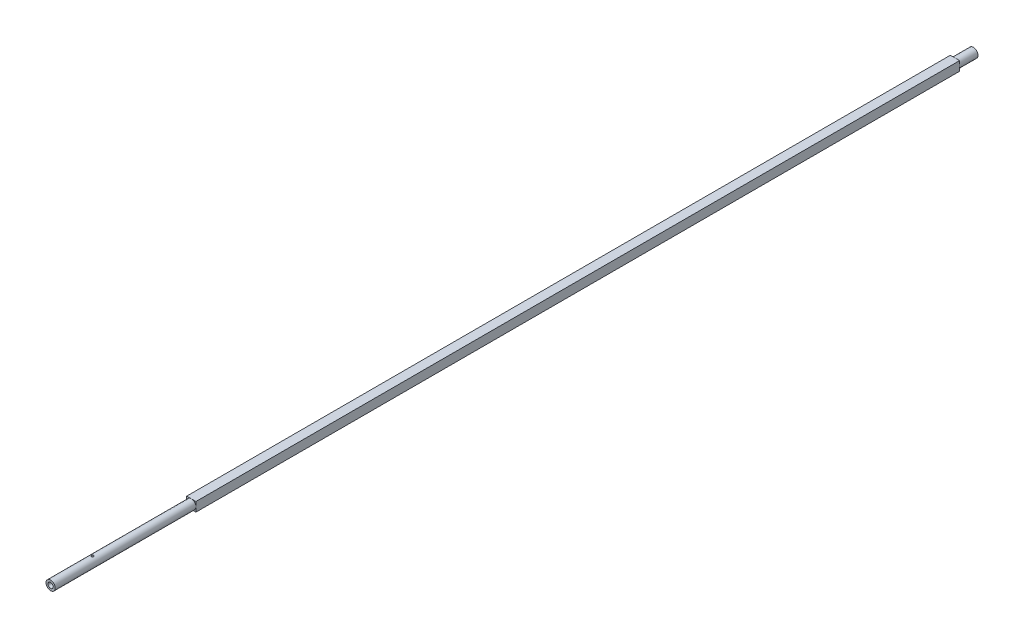
ISO-10303-21;
HEADER;
FILE_DESCRIPTION(('STEP AP214'),'2;1');
FILE_NAME('part.step','',(''),(''),'','','');
FILE_SCHEMA(('AUTOMOTIVE_DESIGN { 1 0 10303 214 1 1 1 1 }'));
ENDSEC;
DATA;
#1=APPLICATION_CONTEXT('core data for automotive mechanical design processes');
#2=APPLICATION_PROTOCOL_DEFINITION('international standard','automotive_design',2000,#1);
#3=PRODUCT_CONTEXT('',#1,'mechanical');
#4=PRODUCT('Part','Part','',(#3));
#5=PRODUCT_RELATED_PRODUCT_CATEGORY('part','',(#4));
#6=PRODUCT_DEFINITION_FORMATION('','',#4);
#7=PRODUCT_DEFINITION_CONTEXT('part definition',#1,'design');
#8=PRODUCT_DEFINITION('design','',#6,#7);
#9=PRODUCT_DEFINITION_SHAPE('','',#8);
#10=(LENGTH_UNIT() NAMED_UNIT(*) SI_UNIT(.MILLI.,.METRE.));
#11=(NAMED_UNIT(*) PLANE_ANGLE_UNIT() SI_UNIT($,.RADIAN.));
#12=(NAMED_UNIT(*) SI_UNIT($,.STERADIAN.) SOLID_ANGLE_UNIT());
#13=UNCERTAINTY_MEASURE_WITH_UNIT(LENGTH_MEASURE(1.E-05),#10,'distance_accuracy_value','');
#14=(GEOMETRIC_REPRESENTATION_CONTEXT(3) GLOBAL_UNCERTAINTY_ASSIGNED_CONTEXT((#13)) GLOBAL_UNIT_ASSIGNED_CONTEXT((#10,
#11,#12)) REPRESENTATION_CONTEXT('',''));
#15=CARTESIAN_POINT('',(0.,0.,0.));
#16=DIRECTION('',(0.,0.,1.));
#17=DIRECTION('',(1.,0.,0.));
#18=AXIS2_PLACEMENT_3D('',#15,#16,#17);
#19=CARTESIAN_POINT('',(0.,0.,0.));
#20=DIRECTION('',(0.,0.,-1.));
#21=DIRECTION('',(-1.,0.,0.));
#22=AXIS2_PLACEMENT_3D('',#19,#20,#21);
#23=CYLINDRICAL_SURFACE('',#22,3.15499999999999);
#24=CARTESIAN_POINT('',(0.,-3.15499999999999,68.27));
#25=CARTESIAN_POINT('',(-0.0428434035980619,-3.15499926048428,68.269998755018));
#26=CARTESIAN_POINT('',(-0.0857008689730935,-3.15411858978364,68.2664353493159));
#27=CARTESIAN_POINT('',(-0.17018910161884,-3.15069071162756,68.2522962573295));
#28=CARTESIAN_POINT('',(-0.211819132037599,-3.14814252359348,68.2417164450189));
#29=CARTESIAN_POINT('',(-0.292620072576786,-3.14166201143922,68.2139032503667));
#30=CARTESIAN_POINT('',(-0.331793817241801,-3.13773131870047,68.1966777077995));
#31=CARTESIAN_POINT('',(-0.406695385445936,-3.12890523512156,68.1560892192831));
#32=CARTESIAN_POINT('',(-0.442423122027183,-3.12400981994672,68.1327261185118));
#33=CARTESIAN_POINT('',(-0.510130903957554,-3.11367735158937,68.0800336300612));
#34=CARTESIAN_POINT('',(-0.542032461447429,-3.10823217478582,68.0506049758489));
#35=CARTESIAN_POINT('',(-0.600500381895767,-3.09746832578942,67.9868293666961));
#36=CARTESIAN_POINT('',(-0.627066162448737,-3.09214966746199,67.9524818755596));
#37=CARTESIAN_POINT('',(-0.674474185695767,-3.082159435371,67.8792384405704));
#38=CARTESIAN_POINT('',(-0.695229253223512,-3.07749818972666,67.8402845347032));
#39=CARTESIAN_POINT('',(-0.729866294223732,-3.06946876016744,67.7593076903811));
#40=CARTESIAN_POINT('',(-0.743749324909623,-3.06610037737282,67.7172852251442));
#41=CARTESIAN_POINT('',(-0.763981667633034,-3.06112144443012,67.6322255380142));
#42=CARTESIAN_POINT('',(-0.770471795620135,-3.05947808637917,67.5892237751899));
#43=CARTESIAN_POINT('',(-0.776172614536864,-3.0580370200745,67.5027128164703));
#44=CARTESIAN_POINT('',(-0.77538444634608,-3.05823902255878,67.4592037011708));
#45=CARTESIAN_POINT('',(-0.766663538406798,-3.06043633103726,67.3739874773659));
#46=CARTESIAN_POINT('',(-0.758897963327654,-3.06238967605256,67.3322620112507));
#47=CARTESIAN_POINT('',(-0.736709073607197,-3.06780278377902,67.2507249777486));
#48=CARTESIAN_POINT('',(-0.722285299303879,-3.07126265049497,67.2109135427101));
#49=CARTESIAN_POINT('',(-0.687045395789382,-3.07933788839243,67.1338832586499));
#50=CARTESIAN_POINT('',(-0.666168073404984,-3.0839642393672,67.0966936036748));
#51=CARTESIAN_POINT('',(-0.618656532309677,-3.09384489758779,67.026285212751));
#52=CARTESIAN_POINT('',(-0.592021338374359,-3.09909931114257,66.9930671509626));
#53=CARTESIAN_POINT('',(-0.532881439131852,-3.1098212306966,66.9305862434724));
#54=CARTESIAN_POINT('',(-0.500235502628048,-3.11529062373362,66.9014572381472));
#55=CARTESIAN_POINT('',(-0.430457000832696,-3.12569579383268,66.8490624417174));
#56=CARTESIAN_POINT('',(-0.393324307698854,-3.13063155568223,66.825796817738));
#57=CARTESIAN_POINT('',(-0.315439460001198,-3.13943654001288,66.7857424688628));
#58=CARTESIAN_POINT('',(-0.274676023963125,-3.14330227322213,66.7689748639727));
#59=CARTESIAN_POINT('',(-0.190793091323864,-3.14950620185087,66.7425669854447));
#60=CARTESIAN_POINT('',(-0.147674030965758,-3.15184467907394,66.7329253968975));
#61=CARTESIAN_POINT('',(-0.0614486931992635,-3.15468914288634,66.7212462063279));
#62=CARTESIAN_POINT('',(-0.0183685274254357,-3.15523906320459,66.7190262616943));
#63=CARTESIAN_POINT('',(0.0675476236497106,-3.15456928701988,66.7217541229676));
#64=CARTESIAN_POINT('',(0.110383629799756,-3.15334974395432,66.7267013073835));
#65=CARTESIAN_POINT('',(0.193966197740732,-3.14930616413586,66.7434725379454));
#66=CARTESIAN_POINT('',(0.23473382509393,-3.14650521900655,66.7551976700822));
#67=CARTESIAN_POINT('',(0.313721801449216,-3.13961412652606,66.7850794509468));
#68=CARTESIAN_POINT('',(0.351941898010841,-3.13552385164174,66.8032367359285));
#69=CARTESIAN_POINT('',(0.42547958392159,-3.12640207341987,66.845824648126));
#70=CARTESIAN_POINT('',(0.460735692863985,-3.12135554355747,66.8703581401234));
#71=CARTESIAN_POINT('',(0.526695422691903,-3.11090566670997,66.9248700020623));
#72=CARTESIAN_POINT('',(0.557398284994112,-3.10550226048454,66.9548492774392));
#73=CARTESIAN_POINT('',(0.614127020455047,-3.09479039352677,67.0202470514131));
#74=CARTESIAN_POINT('',(0.640025199323583,-3.08948719539553,67.0557773609553));
#75=CARTESIAN_POINT('',(0.685490746342258,-3.07971919430867,67.1307878390656));
#76=CARTESIAN_POINT('',(0.705058397210639,-3.07525435391615,67.1702678311398));
#77=CARTESIAN_POINT('',(0.737162929617569,-3.06771704697936,67.2518433424251));
#78=CARTESIAN_POINT('',(0.749741449844652,-3.0646363557007,67.2939216751133));
#79=CARTESIAN_POINT('',(0.767622634584383,-3.0602070090432,67.3796826301342));
#80=CARTESIAN_POINT('',(0.772926825028732,-3.05885799041625,67.4233649140323));
#81=CARTESIAN_POINT('',(0.776031146509615,-3.05807173201391,67.5097962465477));
#82=CARTESIAN_POINT('',(0.774035107202722,-3.0585825616097,67.5525376211588));
#83=CARTESIAN_POINT('',(0.763060538255976,-3.06133876001959,67.6370544045251));
#84=CARTESIAN_POINT('',(0.754082139670096,-3.06358409627821,67.6788298313953));
#85=CARTESIAN_POINT('',(0.729507243124496,-3.06952788434702,67.7600160142471));
#86=CARTESIAN_POINT('',(0.713947723814153,-3.07321820844353,67.7994385993389));
#87=CARTESIAN_POINT('',(0.676681749216461,-3.08163757135176,67.8751413221453));
#88=CARTESIAN_POINT('',(0.6549744708751,-3.08636674922484,67.911421038247));
#89=CARTESIAN_POINT('',(0.605384741907677,-3.09648008399222,67.9807961092229));
#90=CARTESIAN_POINT('',(0.577360283757076,-3.10187775774646,68.0137880032733));
#91=CARTESIAN_POINT('',(0.516210101989471,-3.11263781553505,68.0746671899676));
#92=CARTESIAN_POINT('',(0.48308317486633,-3.1180001909317,68.1025532749125));
#93=CARTESIAN_POINT('',(0.411976050375955,-3.12819619645481,68.1528990319865));
#94=CARTESIAN_POINT('',(0.373921741092796,-3.13301906187442,68.1752563692315));
#95=CARTESIAN_POINT('',(0.294480382839351,-3.14148001054233,68.2132208756048));
#96=CARTESIAN_POINT('',(0.253095809905168,-3.14511896405556,68.2288330057525));
#97=CARTESIAN_POINT('',(0.176472252043087,-3.15024746023148,68.2504770036731));
#98=CARTESIAN_POINT('',(0.141606284601708,-3.15201760271577,68.2577825868709));
#99=CARTESIAN_POINT('',(0.0711634120339031,-3.1543941390154,68.2675444324384));
#100=CARTESIAN_POINT('',(0.0355865568264515,-3.15500061425601,68.270001034106));
#101=CARTESIAN_POINT('',(0.,-3.15499999999999,68.27));
#102=B_SPLINE_CURVE_WITH_KNOTS('',3,(#24,#25,#26,#27,#28,#29,#30,#31,#32,#33,#34,#35,#36,#37,
#38,#39,#40,#41,#42,#43,#44,#45,#46,#47,#48,#49,#50,#51,#52,#53,#54,#55,#56,#57,#58,#59,#60,#61,
#62,#63,#64,#65,#66,#67,#68,#69,#70,#71,#72,#73,#74,#75,#76,#77,#78,#79,#80,#81,#82,#83,#84,#85,
#86,#87,#88,#89,#90,#91,#92,#93,#94,#95,#96,#97,#98,#99,#100,#101),.UNSPECIFIED.,.T.,.F.,(4,2,2,
2,2,2,2,2,2,2,2,2,2,2,2,2,2,2,2,2,2,2,2,2,2,2,2,2,2,2,2,2,2,2,2,2,2,2,4),(0.,0.128399821935004,
0.256875216937389,0.385199514403914,0.513527049207631,0.64415054044558,0.774788281631842,
0.907292049588047,1.03977542645266,1.1696907692188,1.29958574798176,1.42644932142466,
1.55332165445643,1.6814359524321,1.80957196645618,1.94123062996794,2.07289304574835,
2.20497987471762,2.33704232462521,2.46583530198566,2.59461711184787,2.72156535647552,
2.84852616204126,2.97767822314938,3.10685177722885,3.23907840362815,3.37129912403644,
3.50272343601714,3.63412017498147,3.76187654884372,3.88963052486656,4.0166760056436,
4.14373850315174,4.27400743179467,4.40430713381773,4.53686330216085,4.6693218103635,
4.77598064085279,4.88263200783249),.UNSPECIFIED.);
#103=CARTESIAN_POINT('',(0.,-3.15499999999999,68.27));
#104=VERTEX_POINT('',#103);
#105=EDGE_CURVE('E35',#104,#104,#102,.T.);
#106=ORIENTED_EDGE('',*,*,#105,.F.);
#107=EDGE_LOOP('',(#106));
#108=FACE_BOUND('',#107,.T.);
#109=CARTESIAN_POINT('',(0.,3.15499999999999,68.27));
#110=CARTESIAN_POINT('',(0.042843403598062,3.15499926048428,68.269998755018));
#111=CARTESIAN_POINT('',(0.0857008689730936,3.15411858978364,68.2664353493159));
#112=CARTESIAN_POINT('',(0.170189101618841,3.15069071162756,68.2522962573295));
#113=CARTESIAN_POINT('',(0.211819132037599,3.14814252359348,68.2417164450189));
#114=CARTESIAN_POINT('',(0.292620072576786,3.14166201143922,68.2139032503667));
#115=CARTESIAN_POINT('',(0.331793817241802,3.13773131870047,68.1966777077995));
#116=CARTESIAN_POINT('',(0.406695385445937,3.12890523512156,68.1560892192831));
#117=CARTESIAN_POINT('',(0.442423122027183,3.12400981994672,68.1327261185118));
#118=CARTESIAN_POINT('',(0.510130903957554,3.11367735158937,68.0800336300612));
#119=CARTESIAN_POINT('',(0.542032461447429,3.10823217478582,68.0506049758489));
#120=CARTESIAN_POINT('',(0.600500381895767,3.09746832578942,67.9868293666961));
#121=CARTESIAN_POINT('',(0.627066162448737,3.09214966746199,67.9524818755596));
#122=CARTESIAN_POINT('',(0.674474185695767,3.082159435371,67.8792384405704));
#123=CARTESIAN_POINT('',(0.695229253223512,3.07749818972666,67.8402845347032));
#124=CARTESIAN_POINT('',(0.729866294223732,3.06946876016744,67.7593076903811));
#125=CARTESIAN_POINT('',(0.743749324909623,3.06610037737282,67.7172852251442));
#126=CARTESIAN_POINT('',(0.763981667633034,3.06112144443012,67.6322255380142));
#127=CARTESIAN_POINT('',(0.770471795620135,3.05947808637917,67.5892237751899));
#128=CARTESIAN_POINT('',(0.776172614536864,3.0580370200745,67.5027128164703));
#129=CARTESIAN_POINT('',(0.77538444634608,3.05823902255878,67.4592037011708));
#130=CARTESIAN_POINT('',(0.766663538406797,3.06043633103726,67.3739874773658));
#131=CARTESIAN_POINT('',(0.758897963327653,3.06238967605256,67.3322620112507));
#132=CARTESIAN_POINT('',(0.736709073607194,3.06780278377903,67.2507249777486));
#133=CARTESIAN_POINT('',(0.722285299303877,3.07126265049497,67.2109135427101));
#134=CARTESIAN_POINT('',(0.687045395789382,3.07933788839243,67.1338832586499));
#135=CARTESIAN_POINT('',(0.666168073404984,3.0839642393672,67.0966936036748));
#136=CARTESIAN_POINT('',(0.618656532309677,3.09384489758779,67.026285212751));
#137=CARTESIAN_POINT('',(0.592021338374359,3.09909931114257,66.9930671509626));
#138=CARTESIAN_POINT('',(0.532881439131851,3.1098212306966,66.9305862434724));
#139=CARTESIAN_POINT('',(0.500235502628048,3.11529062373362,66.9014572381472));
#140=CARTESIAN_POINT('',(0.430457000832696,3.12569579383268,66.8490624417174));
#141=CARTESIAN_POINT('',(0.393324307698855,3.13063155568223,66.825796817738));
#142=CARTESIAN_POINT('',(0.315439460001199,3.13943654001288,66.7857424688628));
#143=CARTESIAN_POINT('',(0.274676023963124,3.14330227322213,66.7689748639727));
#144=CARTESIAN_POINT('',(0.190793091323863,3.14950620185087,66.7425669854447));
#145=CARTESIAN_POINT('',(0.147674030965759,3.15184467907394,66.7329253968975));
#146=CARTESIAN_POINT('',(0.0614486931992647,3.15468914288634,66.7212462063279));
#147=CARTESIAN_POINT('',(0.0183685274254362,3.15523906320459,66.7190262616943));
#148=CARTESIAN_POINT('',(-0.0675476236497105,3.15456928701988,66.7217541229676));
#149=CARTESIAN_POINT('',(-0.110383629799755,3.15334974395432,66.7267013073835));
#150=CARTESIAN_POINT('',(-0.193966197740731,3.14930616413586,66.7434725379454));
#151=CARTESIAN_POINT('',(-0.23473382509393,3.14650521900655,66.7551976700822));
#152=CARTESIAN_POINT('',(-0.313721801449215,3.13961412652606,66.7850794509468));
#153=CARTESIAN_POINT('',(-0.351941898010841,3.13552385164174,66.8032367359285));
#154=CARTESIAN_POINT('',(-0.425479583921589,3.12640207341987,66.845824648126));
#155=CARTESIAN_POINT('',(-0.460735692863984,3.12135554355747,66.8703581401234));
#156=CARTESIAN_POINT('',(-0.526695422691903,3.11090566670997,66.9248700020623));
#157=CARTESIAN_POINT('',(-0.557398284994112,3.10550226048454,66.9548492774392));
#158=CARTESIAN_POINT('',(-0.614127020455049,3.09479039352677,67.0202470514131));
#159=CARTESIAN_POINT('',(-0.640025199323587,3.08948719539553,67.0557773609553));
#160=CARTESIAN_POINT('',(-0.685490746342261,3.07971919430867,67.1307878390656));
#161=CARTESIAN_POINT('',(-0.70505839721064,3.07525435391615,67.1702678311398));
#162=CARTESIAN_POINT('',(-0.73716292961757,3.06771704697936,67.2518433424251));
#163=CARTESIAN_POINT('',(-0.749741449844652,3.0646363557007,67.2939216751133));
#164=CARTESIAN_POINT('',(-0.767622634584383,3.0602070090432,67.3796826301342));
#165=CARTESIAN_POINT('',(-0.772926825028732,3.05885799041625,67.4233649140323));
#166=CARTESIAN_POINT('',(-0.776031146509615,3.05807173201391,67.5097962465477));
#167=CARTESIAN_POINT('',(-0.774035107202722,3.0585825616097,67.5525376211588));
#168=CARTESIAN_POINT('',(-0.763060538255976,3.06133876001959,67.6370544045251));
#169=CARTESIAN_POINT('',(-0.754082139670096,3.06358409627821,67.6788298313953));
#170=CARTESIAN_POINT('',(-0.729507243124496,3.06952788434702,67.7600160142471));
#171=CARTESIAN_POINT('',(-0.713947723814153,3.07321820844353,67.7994385993389));
#172=CARTESIAN_POINT('',(-0.676681749216461,3.08163757135176,67.8751413221453));
#173=CARTESIAN_POINT('',(-0.6549744708751,3.08636674922484,67.911421038247));
#174=CARTESIAN_POINT('',(-0.605384741907677,3.09648008399222,67.9807961092229));
#175=CARTESIAN_POINT('',(-0.577360283757076,3.10187775774646,68.0137880032733));
#176=CARTESIAN_POINT('',(-0.516210101989471,3.11263781553505,68.0746671899676));
#177=CARTESIAN_POINT('',(-0.48308317486633,3.1180001909317,68.1025532749125));
#178=CARTESIAN_POINT('',(-0.411976050375955,3.12819619645481,68.1528990319865));
#179=CARTESIAN_POINT('',(-0.373921741092796,3.13301906187442,68.1752563692315));
#180=CARTESIAN_POINT('',(-0.294480382839352,3.14148001054233,68.2132208756048));
#181=CARTESIAN_POINT('',(-0.253095809905168,3.14511896405556,68.2288330057525));
#182=CARTESIAN_POINT('',(-0.176472252043087,3.15024746023148,68.2504770036731));
#183=CARTESIAN_POINT('',(-0.141606284601709,3.15201760271577,68.2577825868709));
#184=CARTESIAN_POINT('',(-0.0711634120339038,3.1543941390154,68.2675444324384));
#185=CARTESIAN_POINT('',(-0.0355865568264518,3.15500061425601,68.270001034106));
#186=CARTESIAN_POINT('',(0.,3.15499999999999,68.27));
#187=B_SPLINE_CURVE_WITH_KNOTS('',3,(#109,#110,#111,#112,#113,#114,#115,#116,#117,#118,#119,
#120,#121,#122,#123,#124,#125,#126,#127,#128,#129,#130,#131,#132,#133,#134,#135,#136,#137,#138,
#139,#140,#141,#142,#143,#144,#145,#146,#147,#148,#149,#150,#151,#152,#153,#154,#155,#156,#157,
#158,#159,#160,#161,#162,#163,#164,#165,#166,#167,#168,#169,#170,#171,#172,#173,#174,#175,#176,
#177,#178,#179,#180,#181,#182,#183,#184,#185,#186),.UNSPECIFIED.,.T.,.F.,(4,2,2,2,2,2,2,2,2,2,2,
2,2,2,2,2,2,2,2,2,2,2,2,2,2,2,2,2,2,2,2,2,2,2,2,2,2,2,4),(0.,0.128399821935005,
0.256875216937389,0.385199514403914,0.513527049207631,0.64415054044558,0.774788281631841,
0.907292049588047,1.03977542645266,1.1696907692188,1.29958574798176,1.42644932142467,
1.55332165445643,1.6814359524321,1.80957196645618,1.94123062996794,2.07289304574835,
2.20497987471762,2.3370423246252,2.46583530198565,2.59461711184786,2.72156535647552,
2.84852616204126,2.97767822314938,3.10685177722885,3.23907840362816,3.37129912403644,
3.50272343601714,3.63412017498146,3.76187654884372,3.88963052486656,4.0166760056436,
4.14373850315173,4.27400743179467,4.40430713381772,4.53686330216085,4.6693218103635,
4.77598064085278,4.88263200783248),.UNSPECIFIED.);
#188=CARTESIAN_POINT('',(0.,3.15499999999999,68.27));
#189=VERTEX_POINT('',#188);
#190=EDGE_CURVE('E105',#189,#189,#187,.T.);
#191=ORIENTED_EDGE('',*,*,#190,.F.);
#192=EDGE_LOOP('',(#191));
#193=FACE_BOUND('',#192,.T.);
#194=CARTESIAN_POINT('',(0.,0.,0.));
#195=DIRECTION('',(0.,0.,1.));
#196=DIRECTION('',(1.,0.,0.));
#197=AXIS2_PLACEMENT_3D('',#194,#195,#196);
#198=CIRCLE('',#197,3.15499999999999);
#199=CARTESIAN_POINT('',(3.15499999999999,0.,0.));
#200=VERTEX_POINT('',#199);
#201=EDGE_CURVE('E11',#200,#200,#198,.F.);
#202=ORIENTED_EDGE('',*,*,#201,.F.);
#203=EDGE_LOOP('',(#202));
#204=FACE_BOUND('',#203,.T.);
#205=CARTESIAN_POINT('',(0.,0.,96.02));
#206=DIRECTION('',(0.,0.,-1.));
#207=DIRECTION('',(-1.,0.,0.));
#208=AXIS2_PLACEMENT_3D('',#205,#206,#207);
#209=CIRCLE('',#208,3.15499999999999);
#210=CARTESIAN_POINT('',(-3.15499999999999,0.,96.02));
#211=VERTEX_POINT('',#210);
#212=EDGE_CURVE('E125',#211,#211,#209,.T.);
#213=ORIENTED_EDGE('',*,*,#212,.T.);
#214=EDGE_LOOP('',(#213));
#215=FACE_BOUND('',#214,.T.);
#216=ADVANCED_FACE('F31',(#108,#193,#204,#215),#23,.T.);
#217=CARTESIAN_POINT('',(0.,0.,96.02));
#218=DIRECTION('',(0.,0.,1.));
#219=DIRECTION('',(1.,0.,0.));
#220=AXIS2_PLACEMENT_3D('',#217,#218,#219);
#221=CONICAL_SURFACE('',#220,1.80499999999999,0.346440567429855);
#222=CARTESIAN_POINT('',(0.,0.,91.02));
#223=VERTEX_POINT('',#222);
#224=VERTEX_LOOP('',#223);
#225=FACE_BOUND('',#224,.T.);
#226=CARTESIAN_POINT('',(0.,0.,96.02));
#227=DIRECTION('',(0.,0.,-1.));
#228=DIRECTION('',(-1.,0.,0.));
#229=AXIS2_PLACEMENT_3D('',#226,#227,#228);
#230=CIRCLE('',#229,1.80499999999999);
#231=CARTESIAN_POINT('',(-1.80499999999999,0.,96.02));
#232=VERTEX_POINT('',#231);
#233=EDGE_CURVE('E128',#232,#232,#230,.T.);
#234=ORIENTED_EDGE('',*,*,#233,.F.);
#235=EDGE_LOOP('',(#234));
#236=FACE_BOUND('',#235,.T.);
#237=ADVANCED_FACE('F170',(#225,#236),#221,.F.);
#238=CARTESIAN_POINT('',(0.,1.80499999999999,96.02));
#239=DIRECTION('',(0.,0.,1.));
#240=DIRECTION('',(1.,0.,0.));
#241=AXIS2_PLACEMENT_3D('',#238,#239,#240);
#242=PLANE('',#241);
#243=ORIENTED_EDGE('',*,*,#233,.T.);
#244=EDGE_LOOP('',(#243));
#245=FACE_BOUND('',#244,.T.);
#246=ORIENTED_EDGE('',*,*,#212,.F.);
#247=EDGE_LOOP('',(#246));
#248=FACE_BOUND('',#247,.T.);
#249=ADVANCED_FACE('F166',(#245,#248),#242,.T.);
#250=CARTESIAN_POINT('',(3.16,-3.16,-521.14));
#251=DIRECTION('',(1.,0.,0.));
#252=DIRECTION('',(0.,0.,-1.));
#253=AXIS2_PLACEMENT_3D('',#250,#251,#252);
#254=PLANE('',#253);
#255=DIRECTION('',(0.,1.,0.));
#256=VECTOR('',#255,1.);
#257=CARTESIAN_POINT('',(3.16,-3.16,-521.14));
#258=LINE('',#257,#256);
#259=CARTESIAN_POINT('',(3.16,-3.16,-521.14));
#260=VERTEX_POINT('',#259);
#261=CARTESIAN_POINT('',(3.16,3.16,-521.14));
#262=VERTEX_POINT('',#261);
#263=EDGE_CURVE('E78',#260,#262,#258,.T.);
#264=ORIENTED_EDGE('',*,*,#263,.T.);
#265=DIRECTION('',(0.,0.,-1.));
#266=VECTOR('',#265,1.);
#267=CARTESIAN_POINT('',(3.16,3.16,-521.14));
#268=LINE('',#267,#266);
#269=CARTESIAN_POINT('',(3.15999999999994,3.16,0.));
#270=VERTEX_POINT('',#269);
#271=EDGE_CURVE('E82',#270,#262,#268,.T.);
#272=ORIENTED_EDGE('',*,*,#271,.F.);
#273=DIRECTION('',(0.,1.,0.));
#274=VECTOR('',#273,1.);
#275=CARTESIAN_POINT('',(3.15999999999994,-3.16,0.));
#276=LINE('',#275,#274);
#277=CARTESIAN_POINT('',(3.15999999999994,-3.16,0.));
#278=VERTEX_POINT('',#277);
#279=EDGE_CURVE('E117',#278,#270,#276,.T.);
#280=ORIENTED_EDGE('',*,*,#279,.F.);
#281=DIRECTION('',(0.,0.,-1.));
#282=VECTOR('',#281,1.);
#283=CARTESIAN_POINT('',(3.16,-3.16,-521.14));
#284=LINE('',#283,#282);
#285=EDGE_CURVE('E84',#278,#260,#284,.T.);
#286=ORIENTED_EDGE('',*,*,#285,.T.);
#287=EDGE_LOOP('',(#264,#272,#280,#286));
#288=FACE_BOUND('',#287,.T.);
#289=ADVANCED_FACE('F80',(#288),#254,.T.);
#290=CARTESIAN_POINT('',(3.15999999999994,-3.16,0.));
#291=DIRECTION('',(0.,0.,1.));
#292=DIRECTION('',(1.,0.,0.));
#293=AXIS2_PLACEMENT_3D('',#290,#291,#292);
#294=PLANE('',#293);
#295=ORIENTED_EDGE('',*,*,#201,.T.);
#296=EDGE_LOOP('',(#295));
#297=FACE_BOUND('',#296,.T.);
#298=ORIENTED_EDGE('',*,*,#279,.T.);
#299=DIRECTION('',(1.,0.,0.));
#300=VECTOR('',#299,1.);
#301=CARTESIAN_POINT('',(3.15999999999994,3.16,0.));
#302=LINE('',#301,#300);
#303=CARTESIAN_POINT('',(-3.15999999999994,3.16,0.));
#304=VERTEX_POINT('',#303);
#305=EDGE_CURVE('E102',#304,#270,#302,.T.);
#306=ORIENTED_EDGE('',*,*,#305,.F.);
#307=DIRECTION('',(0.,1.,0.));
#308=VECTOR('',#307,1.);
#309=CARTESIAN_POINT('',(-3.15999999999994,-3.16,0.));
#310=LINE('',#309,#308);
#311=CARTESIAN_POINT('',(-3.15999999999994,-3.16,0.));
#312=VERTEX_POINT('',#311);
#313=EDGE_CURVE('E120',#312,#304,#310,.T.);
#314=ORIENTED_EDGE('',*,*,#313,.F.);
#315=DIRECTION('',(1.,0.,0.));
#316=VECTOR('',#315,1.);
#317=CARTESIAN_POINT('',(3.15999999999994,-3.16,0.));
#318=LINE('',#317,#316);
#319=EDGE_CURVE('E89',#312,#278,#318,.T.);
#320=ORIENTED_EDGE('',*,*,#319,.T.);
#321=EDGE_LOOP('',(#298,#306,#314,#320));
#322=FACE_BOUND('',#321,.T.);
#323=ADVANCED_FACE('F155',(#297,#322),#294,.T.);
#324=CARTESIAN_POINT('',(-3.16,-3.16,-521.14));
#325=DIRECTION('',(-1.,0.,0.));
#326=DIRECTION('',(0.,0.,1.));
#327=AXIS2_PLACEMENT_3D('',#324,#325,#326);
#328=PLANE('',#327);
#329=ORIENTED_EDGE('',*,*,#313,.T.);
#330=DIRECTION('',(0.,0.,1.));
#331=VECTOR('',#330,1.);
#332=CARTESIAN_POINT('',(-3.16,3.16,-521.14));
#333=LINE('',#332,#331);
#334=CARTESIAN_POINT('',(-3.16,3.16,-521.14));
#335=VERTEX_POINT('',#334);
#336=EDGE_CURVE('E97',#335,#304,#333,.T.);
#337=ORIENTED_EDGE('',*,*,#336,.F.);
#338=DIRECTION('',(0.,1.,0.));
#339=VECTOR('',#338,1.);
#340=CARTESIAN_POINT('',(-3.16,-3.16,-521.14));
#341=LINE('',#340,#339);
#342=CARTESIAN_POINT('',(-3.16,-3.16,-521.14));
#343=VERTEX_POINT('',#342);
#344=EDGE_CURVE('E88',#343,#335,#341,.T.);
#345=ORIENTED_EDGE('',*,*,#344,.F.);
#346=DIRECTION('',(0.,0.,1.));
#347=VECTOR('',#346,1.);
#348=CARTESIAN_POINT('',(-3.16,-3.16,-521.14));
#349=LINE('',#348,#347);
#350=EDGE_CURVE('E112',#343,#312,#349,.T.);
#351=ORIENTED_EDGE('',*,*,#350,.T.);
#352=EDGE_LOOP('',(#329,#337,#345,#351));
#353=FACE_BOUND('',#352,.T.);
#354=ADVANCED_FACE('F158',(#353),#328,.T.);
#355=CARTESIAN_POINT('',(3.16,-3.16,-521.14));
#356=DIRECTION('',(0.,0.,-1.));
#357=DIRECTION('',(-1.,0.,0.));
#358=AXIS2_PLACEMENT_3D('',#355,#356,#357);
#359=PLANE('',#358);
#360=CARTESIAN_POINT('',(0.,0.,-521.14));
#361=DIRECTION('',(0.,0.,-1.));
#362=DIRECTION('',(-1.,0.,0.));
#363=AXIS2_PLACEMENT_3D('',#360,#361,#362);
#364=CIRCLE('',#363,3.15499999999999);
#365=CARTESIAN_POINT('',(-3.15499999999999,0.,-521.14));
#366=VERTEX_POINT('',#365);
#367=EDGE_CURVE('E44',#366,#366,#364,.F.);
#368=ORIENTED_EDGE('',*,*,#367,.T.);
#369=EDGE_LOOP('',(#368));
#370=FACE_BOUND('',#369,.T.);
#371=ORIENTED_EDGE('',*,*,#344,.T.);
#372=DIRECTION('',(-1.,0.,0.));
#373=VECTOR('',#372,1.);
#374=CARTESIAN_POINT('',(3.16,3.16,-521.14));
#375=LINE('',#374,#373);
#376=EDGE_CURVE('E92',#262,#335,#375,.T.);
#377=ORIENTED_EDGE('',*,*,#376,.F.);
#378=ORIENTED_EDGE('',*,*,#263,.F.);
#379=DIRECTION('',(-1.,0.,0.));
#380=VECTOR('',#379,1.);
#381=CARTESIAN_POINT('',(3.16,-3.16,-521.14));
#382=LINE('',#381,#380);
#383=EDGE_CURVE('E110',#260,#343,#382,.T.);
#384=ORIENTED_EDGE('',*,*,#383,.T.);
#385=EDGE_LOOP('',(#371,#377,#378,#384));
#386=FACE_BOUND('',#385,.T.);
#387=ADVANCED_FACE('F93',(#370,#386),#359,.T.);
#388=CARTESIAN_POINT('',(3.15999999999994,-3.16,0.));
#389=DIRECTION('',(0.,-1.,0.));
#390=DIRECTION('',(0.,0.,-1.));
#391=AXIS2_PLACEMENT_3D('',#388,#389,#390);
#392=PLANE('',#391);
#393=ORIENTED_EDGE('',*,*,#285,.F.);
#394=ORIENTED_EDGE('',*,*,#319,.F.);
#395=ORIENTED_EDGE('',*,*,#350,.F.);
#396=ORIENTED_EDGE('',*,*,#383,.F.);
#397=EDGE_LOOP('',(#393,#394,#395,#396));
#398=FACE_BOUND('',#397,.T.);
#399=ADVANCED_FACE('F151',(#398),#392,.T.);
#400=CARTESIAN_POINT('',(3.15999999999994,3.16,0.));
#401=DIRECTION('',(0.,-1.,0.));
#402=DIRECTION('',(0.,0.,-1.));
#403=AXIS2_PLACEMENT_3D('',#400,#401,#402);
#404=PLANE('',#403);
#405=ORIENTED_EDGE('',*,*,#271,.T.);
#406=ORIENTED_EDGE('',*,*,#376,.T.);
#407=ORIENTED_EDGE('',*,*,#336,.T.);
#408=ORIENTED_EDGE('',*,*,#305,.T.);
#409=EDGE_LOOP('',(#405,#406,#407,#408));
#410=FACE_BOUND('',#409,.T.);
#411=ADVANCED_FACE('F100',(#410),#404,.F.);
#412=CARTESIAN_POINT('',(0.,0.,-528.7));
#413=DIRECTION('',(0.,0.,-1.));
#414=DIRECTION('',(-1.,0.,0.));
#415=AXIS2_PLACEMENT_3D('',#412,#413,#414);
#416=CONICAL_SURFACE('',#415,0.,0.346440567429857);
#417=CARTESIAN_POINT('',(0.,0.,-533.7));
#418=DIRECTION('',(0.,0.,-1.));
#419=DIRECTION('',(-1.,0.,0.));
#420=AXIS2_PLACEMENT_3D('',#417,#418,#419);
#421=CIRCLE('',#420,1.805);
#422=CARTESIAN_POINT('',(-1.805,0.,-533.7));
#423=VERTEX_POINT('',#422);
#424=EDGE_CURVE('E131',#423,#423,#421,.T.);
#425=ORIENTED_EDGE('',*,*,#424,.T.);
#426=EDGE_LOOP('',(#425));
#427=FACE_BOUND('',#426,.T.);
#428=CARTESIAN_POINT('',(0.,0.,-528.7));
#429=VERTEX_POINT('',#428);
#430=VERTEX_LOOP('',#429);
#431=FACE_BOUND('',#430,.T.);
#432=ADVANCED_FACE('F150',(#427,#431),#416,.F.);
#433=CARTESIAN_POINT('',(0.,1.805,-533.7));
#434=DIRECTION('',(0.,0.,-1.));
#435=DIRECTION('',(-1.,0.,0.));
#436=AXIS2_PLACEMENT_3D('',#433,#434,#435);
#437=PLANE('',#436);
#438=CARTESIAN_POINT('',(0.,0.,-533.7));
#439=DIRECTION('',(0.,0.,-1.));
#440=DIRECTION('',(-1.,0.,0.));
#441=AXIS2_PLACEMENT_3D('',#438,#439,#440);
#442=CIRCLE('',#441,3.155);
#443=CARTESIAN_POINT('',(-3.155,0.,-533.7));
#444=VERTEX_POINT('',#443);
#445=EDGE_CURVE('E119',#444,#444,#442,.T.);
#446=ORIENTED_EDGE('',*,*,#445,.T.);
#447=EDGE_LOOP('',(#446));
#448=FACE_BOUND('',#447,.T.);
#449=ORIENTED_EDGE('',*,*,#424,.F.);
#450=EDGE_LOOP('',(#449));
#451=FACE_BOUND('',#450,.T.);
#452=ADVANCED_FACE('F33',(#448,#451),#437,.T.);
#453=ORIENTED_EDGE('',*,*,#367,.F.);
#454=EDGE_LOOP('',(#453));
#455=FACE_BOUND('',#454,.T.);
#456=ORIENTED_EDGE('',*,*,#445,.F.);
#457=EDGE_LOOP('',(#456));
#458=FACE_BOUND('',#457,.T.);
#459=ADVANCED_FACE('F138',(#455,#458),#23,.T.);
#460=CARTESIAN_POINT('',(0.,-3.16,67.495));
#461=DIRECTION('',(0.,1.,0.));
#462=DIRECTION('',(0.,0.,1.));
#463=AXIS2_PLACEMENT_3D('',#460,#461,#462);
#464=CYLINDRICAL_SURFACE('',#463,0.774999999999999);
#465=ORIENTED_EDGE('',*,*,#105,.T.);
#466=EDGE_LOOP('',(#465));
#467=FACE_BOUND('',#466,.T.);
#468=ORIENTED_EDGE('',*,*,#190,.T.);
#469=EDGE_LOOP('',(#468));
#470=FACE_BOUND('',#469,.T.);
#471=ADVANCED_FACE('F142',(#467,#470),#464,.F.);
#472=CLOSED_SHELL('',(#216,#237,#249,#289,#323,#354,#387,#399,#411,#432,#452,#459,#471));
#473=MANIFOLD_SOLID_BREP('B2',#472);
#474=ADVANCED_BREP_SHAPE_REPRESENTATION('',(#18,#473),#14);
#475=SHAPE_DEFINITION_REPRESENTATION(#9,#474);
ENDSEC;
END-ISO-10303-21;
